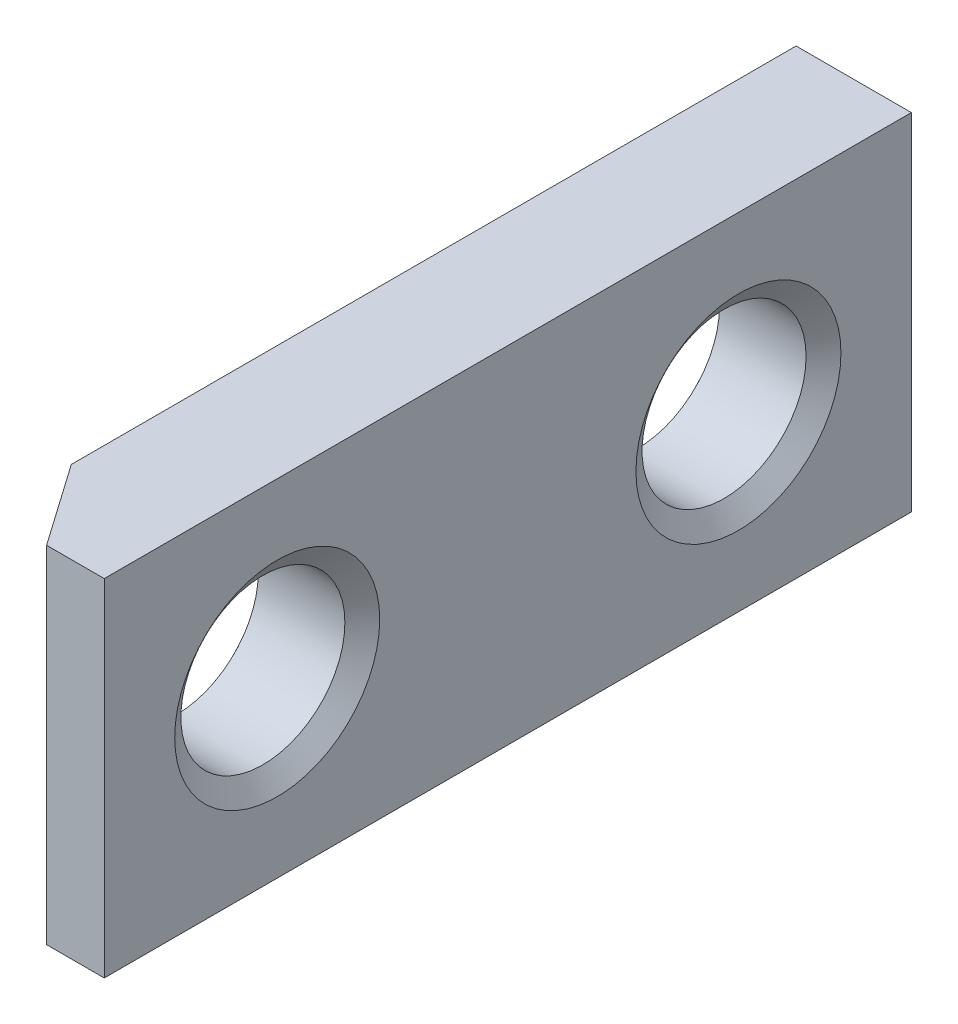
ISO-10303-21;
HEADER;
FILE_DESCRIPTION(('STEP AP214'),'2;1');
FILE_NAME('part.step','',(''),(''),'','','');
FILE_SCHEMA(('AUTOMOTIVE_DESIGN { 1 0 10303 214 1 1 1 1 }'));
ENDSEC;
DATA;
#1=APPLICATION_CONTEXT('core data for automotive mechanical design processes');
#2=APPLICATION_PROTOCOL_DEFINITION('international standard','automotive_design',2000,#1);
#3=PRODUCT_CONTEXT('',#1,'mechanical');
#4=PRODUCT('Part','Part','',(#3));
#5=PRODUCT_RELATED_PRODUCT_CATEGORY('part','',(#4));
#6=PRODUCT_DEFINITION_FORMATION('','',#4);
#7=PRODUCT_DEFINITION_CONTEXT('part definition',#1,'design');
#8=PRODUCT_DEFINITION('design','',#6,#7);
#9=PRODUCT_DEFINITION_SHAPE('','',#8);
#10=(LENGTH_UNIT() NAMED_UNIT(*) SI_UNIT(.MILLI.,.METRE.));
#11=(NAMED_UNIT(*) PLANE_ANGLE_UNIT() SI_UNIT($,.RADIAN.));
#12=(NAMED_UNIT(*) SI_UNIT($,.STERADIAN.) SOLID_ANGLE_UNIT());
#13=UNCERTAINTY_MEASURE_WITH_UNIT(LENGTH_MEASURE(1.E-05),#10,'distance_accuracy_value','');
#14=(GEOMETRIC_REPRESENTATION_CONTEXT(3) GLOBAL_UNCERTAINTY_ASSIGNED_CONTEXT((#13)) GLOBAL_UNIT_ASSIGNED_CONTEXT((#10,
#11,#12)) REPRESENTATION_CONTEXT('',''));
#15=CARTESIAN_POINT('',(0.,0.,0.));
#16=DIRECTION('',(0.,0.,1.));
#17=DIRECTION('',(1.,0.,0.));
#18=AXIS2_PLACEMENT_3D('',#15,#16,#17);
#19=CARTESIAN_POINT('',(2.,3.,-7.));
#20=DIRECTION('',(-1.,0.,0.));
#21=DIRECTION('',(0.,0.,1.));
#22=AXIS2_PLACEMENT_3D('',#19,#20,#21);
#23=PLANE('',#22);
#24=DIRECTION('',(0.,1.,0.));
#25=VECTOR('',#24,1.);
#26=CARTESIAN_POINT('',(2.,-3.,-7.));
#27=LINE('',#26,#25);
#28=CARTESIAN_POINT('',(2.,-3.,-7.));
#29=VERTEX_POINT('',#28);
#30=CARTESIAN_POINT('',(2.,3.,-7.));
#31=VERTEX_POINT('',#30);
#32=EDGE_CURVE('E96',#29,#31,#27,.T.);
#33=ORIENTED_EDGE('',*,*,#32,.T.);
#34=DIRECTION('',(0.,0.,1.));
#35=VECTOR('',#34,1.);
#36=CARTESIAN_POINT('',(2.,3.,7.));
#37=LINE('',#36,#35);
#38=CARTESIAN_POINT('',(2.,3.,7.));
#39=VERTEX_POINT('',#38);
#40=EDGE_CURVE('E85',#31,#39,#37,.T.);
#41=ORIENTED_EDGE('',*,*,#40,.T.);
#42=DIRECTION('',(0.,-1.,0.));
#43=VECTOR('',#42,1.);
#44=CARTESIAN_POINT('',(2.,-3.,7.));
#45=LINE('',#44,#43);
#46=CARTESIAN_POINT('',(2.,-3.,7.));
#47=VERTEX_POINT('',#46);
#48=EDGE_CURVE('E95',#39,#47,#45,.T.);
#49=ORIENTED_EDGE('',*,*,#48,.T.);
#50=DIRECTION('',(0.,0.,-1.));
#51=VECTOR('',#50,1.);
#52=CARTESIAN_POINT('',(2.,-3.,7.));
#53=LINE('',#52,#51);
#54=EDGE_CURVE('E101',#47,#29,#53,.T.);
#55=ORIENTED_EDGE('',*,*,#54,.T.);
#56=EDGE_LOOP('',(#33,#41,#49,#55));
#57=FACE_BOUND('',#56,.T.);
#58=CARTESIAN_POINT('',(2.,0.,-4.));
#59=DIRECTION('',(1.,0.,0.));
#60=DIRECTION('',(0.,0.,-1.));
#61=AXIS2_PLACEMENT_3D('',#58,#59,#60);
#62=CIRCLE('',#61,1.778);
#63=CARTESIAN_POINT('',(2.,0.,-5.778));
#64=VERTEX_POINT('',#63);
#65=EDGE_CURVE('E253',#64,#64,#62,.T.);
#66=ORIENTED_EDGE('',*,*,#65,.F.);
#67=EDGE_LOOP('',(#66));
#68=FACE_BOUND('',#67,.T.);
#69=CARTESIAN_POINT('',(2.,0.,4.));
#70=DIRECTION('',(1.,0.,0.));
#71=DIRECTION('',(0.,0.,-1.));
#72=AXIS2_PLACEMENT_3D('',#69,#70,#71);
#73=CIRCLE('',#72,1.778);
#74=CARTESIAN_POINT('',(2.,0.,2.222));
#75=VERTEX_POINT('',#74);
#76=EDGE_CURVE('E239',#75,#75,#73,.T.);
#77=ORIENTED_EDGE('',*,*,#76,.F.);
#78=EDGE_LOOP('',(#77));
#79=FACE_BOUND('',#78,.T.);
#80=ADVANCED_FACE('F31',(#57,#68,#79),#23,.F.);
#81=CARTESIAN_POINT('',(2.,-3.,-7.));
#82=DIRECTION('',(0.,0.,1.));
#83=DIRECTION('',(1.,0.,0.));
#84=AXIS2_PLACEMENT_3D('',#81,#82,#83);
#85=PLANE('',#84);
#86=DIRECTION('',(0.,1.,0.));
#87=VECTOR('',#86,1.);
#88=CARTESIAN_POINT('',(0.,-3.,-7.));
#89=LINE('',#88,#87);
#90=CARTESIAN_POINT('',(0.,-3.,-7.));
#91=VERTEX_POINT('',#90);
#92=CARTESIAN_POINT('',(0.,3.,-7.));
#93=VERTEX_POINT('',#92);
#94=EDGE_CURVE('E109',#91,#93,#89,.T.);
#95=ORIENTED_EDGE('',*,*,#94,.T.);
#96=DIRECTION('',(-1.,0.,0.));
#97=VECTOR('',#96,1.);
#98=CARTESIAN_POINT('',(2.,3.,-7.));
#99=LINE('',#98,#97);
#100=EDGE_CURVE('E89',#31,#93,#99,.T.);
#101=ORIENTED_EDGE('',*,*,#100,.F.);
#102=ORIENTED_EDGE('',*,*,#32,.F.);
#103=DIRECTION('',(-1.,0.,0.));
#104=VECTOR('',#103,1.);
#105=CARTESIAN_POINT('',(2.,-3.,-7.));
#106=LINE('',#105,#104);
#107=EDGE_CURVE('E264',#29,#91,#106,.T.);
#108=ORIENTED_EDGE('',*,*,#107,.T.);
#109=EDGE_LOOP('',(#95,#101,#102,#108));
#110=FACE_BOUND('',#109,.T.);
#111=ADVANCED_FACE('F107',(#110),#85,.F.);
#112=CARTESIAN_POINT('',(2.,3.,7.));
#113=DIRECTION('',(0.,-1.,0.));
#114=DIRECTION('',(0.,0.,-1.));
#115=AXIS2_PLACEMENT_3D('',#112,#113,#114);
#116=PLANE('',#115);
#117=DIRECTION('',(0.,0.,1.));
#118=VECTOR('',#117,1.);
#119=CARTESIAN_POINT('',(0.,3.,7.));
#120=LINE('',#119,#118);
#121=CARTESIAN_POINT('',(0.,3.,5.57185199325786));
#122=VERTEX_POINT('',#121);
#123=EDGE_CURVE('E266',#93,#122,#120,.T.);
#124=ORIENTED_EDGE('',*,*,#123,.T.);
#125=DIRECTION('',(0.573576436351042,0.,0.819152044288994));
#126=VECTOR('',#125,1.);
#127=CARTESIAN_POINT('',(1.00000000000001,3.,7.));
#128=LINE('',#127,#126);
#129=CARTESIAN_POINT('',(1.00000000000001,3.,7.));
#130=VERTEX_POINT('',#129);
#131=EDGE_CURVE('E11',#122,#130,#128,.T.);
#132=ORIENTED_EDGE('',*,*,#131,.T.);
#133=DIRECTION('',(-1.,0.,0.));
#134=VECTOR('',#133,1.);
#135=CARTESIAN_POINT('',(2.,3.,7.));
#136=LINE('',#135,#134);
#137=EDGE_CURVE('E92',#39,#130,#136,.T.);
#138=ORIENTED_EDGE('',*,*,#137,.F.);
#139=ORIENTED_EDGE('',*,*,#40,.F.);
#140=ORIENTED_EDGE('',*,*,#100,.T.);
#141=EDGE_LOOP('',(#124,#132,#138,#139,#140));
#142=FACE_BOUND('',#141,.T.);
#143=ADVANCED_FACE('F87',(#142),#116,.F.);
#144=CARTESIAN_POINT('',(2.,-3.,7.));
#145=DIRECTION('',(0.,0.,-1.));
#146=DIRECTION('',(-1.,0.,0.));
#147=AXIS2_PLACEMENT_3D('',#144,#145,#146);
#148=PLANE('',#147);
#149=ORIENTED_EDGE('',*,*,#137,.T.);
#150=DIRECTION('',(0.,-1.,0.));
#151=VECTOR('',#150,1.);
#152=CARTESIAN_POINT('',(1.00000000000001,-3.,7.));
#153=LINE('',#152,#151);
#154=CARTESIAN_POINT('',(1.00000000000001,-3.,7.));
#155=VERTEX_POINT('',#154);
#156=EDGE_CURVE('E110',#130,#155,#153,.T.);
#157=ORIENTED_EDGE('',*,*,#156,.T.);
#158=DIRECTION('',(-1.,0.,0.));
#159=VECTOR('',#158,1.);
#160=CARTESIAN_POINT('',(2.,-3.,7.));
#161=LINE('',#160,#159);
#162=EDGE_CURVE('E115',#47,#155,#161,.T.);
#163=ORIENTED_EDGE('',*,*,#162,.F.);
#164=ORIENTED_EDGE('',*,*,#48,.F.);
#165=EDGE_LOOP('',(#149,#157,#163,#164));
#166=FACE_BOUND('',#165,.T.);
#167=ADVANCED_FACE('F153',(#166),#148,.F.);
#168=CARTESIAN_POINT('',(2.,-3.,7.));
#169=DIRECTION('',(0.,1.,0.));
#170=DIRECTION('',(0.,0.,1.));
#171=AXIS2_PLACEMENT_3D('',#168,#169,#170);
#172=PLANE('',#171);
#173=ORIENTED_EDGE('',*,*,#162,.T.);
#174=DIRECTION('',(-0.573576436351042,0.,-0.819152044288994));
#175=VECTOR('',#174,1.);
#176=CARTESIAN_POINT('',(1.00000000000001,-3.,7.));
#177=LINE('',#176,#175);
#178=CARTESIAN_POINT('',(0.,-3.,5.57185199325786));
#179=VERTEX_POINT('',#178);
#180=EDGE_CURVE('E113',#155,#179,#177,.T.);
#181=ORIENTED_EDGE('',*,*,#180,.T.);
#182=DIRECTION('',(0.,0.,-1.));
#183=VECTOR('',#182,1.);
#184=CARTESIAN_POINT('',(0.,-3.,7.));
#185=LINE('',#184,#183);
#186=EDGE_CURVE('E105',#179,#91,#185,.T.);
#187=ORIENTED_EDGE('',*,*,#186,.T.);
#188=ORIENTED_EDGE('',*,*,#107,.F.);
#189=ORIENTED_EDGE('',*,*,#54,.F.);
#190=EDGE_LOOP('',(#173,#181,#187,#188,#189));
#191=FACE_BOUND('',#190,.T.);
#192=ADVANCED_FACE('F150',(#191),#172,.F.);
#193=CARTESIAN_POINT('',(0.,3.,-7.));
#194=DIRECTION('',(-1.,0.,0.));
#195=DIRECTION('',(0.,0.,1.));
#196=AXIS2_PLACEMENT_3D('',#193,#194,#195);
#197=PLANE('',#196);
#198=ORIENTED_EDGE('',*,*,#186,.F.);
#199=DIRECTION('',(0.,1.,0.));
#200=VECTOR('',#199,1.);
#201=CARTESIAN_POINT('',(0.,3.,5.57185199325786));
#202=LINE('',#201,#200);
#203=CARTESIAN_POINT('',(0.,-0.831002594034026,5.57185199325786));
#204=VERTEX_POINT('',#203);
#205=EDGE_CURVE('E53',#179,#204,#202,.T.);
#206=ORIENTED_EDGE('',*,*,#205,.T.);
#207=CARTESIAN_POINT('',(0.,0.,4.));
#208=DIRECTION('',(1.,0.,0.));
#209=DIRECTION('',(0.,0.,-1.));
#210=AXIS2_PLACEMENT_3D('',#207,#208,#209);
#211=CIRCLE('',#210,1.778);
#212=CARTESIAN_POINT('',(0.,0.831002594034028,5.57185199325786));
#213=VERTEX_POINT('',#212);
#214=EDGE_CURVE('E237',#204,#213,#211,.T.);
#215=ORIENTED_EDGE('',*,*,#214,.T.);
#216=DIRECTION('',(0.,1.,0.));
#217=VECTOR('',#216,1.);
#218=CARTESIAN_POINT('',(0.,3.,5.57185199325786));
#219=LINE('',#218,#217);
#220=EDGE_CURVE('E47',#213,#122,#219,.T.);
#221=ORIENTED_EDGE('',*,*,#220,.T.);
#222=ORIENTED_EDGE('',*,*,#123,.F.);
#223=ORIENTED_EDGE('',*,*,#94,.F.);
#224=EDGE_LOOP('',(#198,#206,#215,#221,#222,#223));
#225=FACE_BOUND('',#224,.T.);
#226=CARTESIAN_POINT('',(0.,0.,-4.));
#227=DIRECTION('',(1.,0.,0.));
#228=DIRECTION('',(0.,0.,-1.));
#229=AXIS2_PLACEMENT_3D('',#226,#227,#228);
#230=CIRCLE('',#229,1.778);
#231=CARTESIAN_POINT('',(0.,0.,-5.778));
#232=VERTEX_POINT('',#231);
#233=EDGE_CURVE('E250',#232,#232,#230,.T.);
#234=ORIENTED_EDGE('',*,*,#233,.T.);
#235=EDGE_LOOP('',(#234));
#236=FACE_BOUND('',#235,.T.);
#237=ADVANCED_FACE('F144',(#225,#236),#197,.T.);
#238=CARTESIAN_POINT('',(0.248993800587373,0.,-4.));
#239=DIRECTION('',(-1.,0.,0.));
#240=DIRECTION('',(0.,0.,1.));
#241=AXIS2_PLACEMENT_3D('',#238,#239,#240);
#242=CONICAL_SURFACE('',#241,1.4224,0.959931088596882);
#243=ORIENTED_EDGE('',*,*,#233,.F.);
#244=EDGE_LOOP('',(#243));
#245=FACE_BOUND('',#244,.T.);
#246=CARTESIAN_POINT('',(0.248993800587373,0.,-4.));
#247=DIRECTION('',(1.,0.,0.));
#248=DIRECTION('',(0.,0.,-1.));
#249=AXIS2_PLACEMENT_3D('',#246,#247,#248);
#250=CIRCLE('',#249,1.4224);
#251=CARTESIAN_POINT('',(0.248993800587373,0.,-5.4224));
#252=VERTEX_POINT('',#251);
#253=EDGE_CURVE('E259',#252,#252,#250,.T.);
#254=ORIENTED_EDGE('',*,*,#253,.T.);
#255=EDGE_LOOP('',(#254));
#256=FACE_BOUND('',#255,.T.);
#257=ADVANCED_FACE('F140',(#245,#256),#242,.F.);
#258=CARTESIAN_POINT('',(2.,0.,-4.));
#259=DIRECTION('',(1.,0.,0.));
#260=DIRECTION('',(0.,0.,-1.));
#261=AXIS2_PLACEMENT_3D('',#258,#259,#260);
#262=CYLINDRICAL_SURFACE('',#261,1.4224);
#263=ORIENTED_EDGE('',*,*,#253,.F.);
#264=EDGE_LOOP('',(#263));
#265=FACE_BOUND('',#264,.T.);
#266=CARTESIAN_POINT('',(1.75100619941263,0.,-4.));
#267=DIRECTION('',(1.,0.,0.));
#268=DIRECTION('',(0.,0.,-1.));
#269=AXIS2_PLACEMENT_3D('',#266,#267,#268);
#270=CIRCLE('',#269,1.4224);
#271=CARTESIAN_POINT('',(1.75100619941263,0.,-5.4224));
#272=VERTEX_POINT('',#271);
#273=EDGE_CURVE('E256',#272,#272,#270,.T.);
#274=ORIENTED_EDGE('',*,*,#273,.T.);
#275=EDGE_LOOP('',(#274));
#276=FACE_BOUND('',#275,.T.);
#277=ADVANCED_FACE('F136',(#265,#276),#262,.F.);
#278=CARTESIAN_POINT('',(2.,0.,-4.));
#279=DIRECTION('',(1.,0.,0.));
#280=DIRECTION('',(0.,0.,-1.));
#281=AXIS2_PLACEMENT_3D('',#278,#279,#280);
#282=CONICAL_SURFACE('',#281,1.778,0.959931088596881);
#283=ORIENTED_EDGE('',*,*,#273,.F.);
#284=EDGE_LOOP('',(#283));
#285=FACE_BOUND('',#284,.T.);
#286=ORIENTED_EDGE('',*,*,#65,.T.);
#287=EDGE_LOOP('',(#286));
#288=FACE_BOUND('',#287,.T.);
#289=ADVANCED_FACE('F131',(#285,#288),#282,.F.);
#290=CARTESIAN_POINT('',(0.248993800587373,0.,4.));
#291=DIRECTION('',(-1.,0.,0.));
#292=DIRECTION('',(0.,0.,1.));
#293=AXIS2_PLACEMENT_3D('',#290,#291,#292);
#294=CONICAL_SURFACE('',#293,1.4224,0.959931088596882);
#295=ORIENTED_EDGE('',*,*,#214,.F.);
#296=CARTESIAN_POINT('',(0.,-0.831002594034028,5.57185199325786));
#297=CARTESIAN_POINT('',(0.0139738922372071,-0.750666063989369,5.59180877960286));
#298=CARTESIAN_POINT('',(0.026064994150882,-0.669300159304515,5.60907666270019));
#299=CARTESIAN_POINT('',(0.0462191684725842,-0.505011140824846,5.63785980658526));
#300=CARTESIAN_POINT('',(0.0542794116624237,-0.422086975542478,5.64937102683069));
#301=CARTESIAN_POINT('',(0.0659365462604486,-0.257451319358591,5.66601914037118));
#302=CARTESIAN_POINT('',(0.0696433516518529,-0.175763833673539,5.6713130071023));
#303=CARTESIAN_POINT('',(0.0728568839525601,-0.012195198668549,5.67590240685215));
#304=CARTESIAN_POINT('',(0.0723659212142171,0.0696858193292574,5.675201239396));
#305=CARTESIAN_POINT('',(0.0661635626818426,0.265492324502684,5.66634335342089));
#306=CARTESIAN_POINT('',(0.0584591416749154,0.37924864173589,5.65534029991675));
#307=CARTESIAN_POINT('',(0.0410150926676743,0.549026098495219,5.63042761609754));
#308=CARTESIAN_POINT('',(0.0341271809256541,0.60599858772834,5.62059065867256));
#309=CARTESIAN_POINT('',(0.0184576127370814,0.719135696964129,5.59821219609754));
#310=CARTESIAN_POINT('',(0.00967633911606112,0.775300477835006,5.58567123767903));
#311=CARTESIAN_POINT('',(0.,0.831002594034028,5.57185199325786));
#312=B_SPLINE_CURVE_WITH_KNOTS('',3,(#296,#297,#298,#299,#300,#301,#302,#303,#304,#305,#306,
#307,#308,#309,#310,#311),.UNSPECIFIED.,.F.,.F.,(4,2,2,2,2,2,2,4),(0.,0.251827339558577,
0.503831186917978,0.749325568693761,0.994684844865774,1.33734476051293,1.51193575078704,
1.68649147294029),.UNSPECIFIED.);
#313=EDGE_CURVE('E40',#204,#213,#312,.T.);
#314=ORIENTED_EDGE('',*,*,#313,.T.);
#315=EDGE_LOOP('',(#295,#314));
#316=FACE_BOUND('',#315,.T.);
#317=CARTESIAN_POINT('',(0.248993800587373,0.,4.));
#318=DIRECTION('',(1.,0.,0.));
#319=DIRECTION('',(0.,0.,-1.));
#320=AXIS2_PLACEMENT_3D('',#317,#318,#319);
#321=CIRCLE('',#320,1.4224);
#322=CARTESIAN_POINT('',(0.248993800587373,0.,2.5776));
#323=VERTEX_POINT('',#322);
#324=EDGE_CURVE('E247',#323,#323,#321,.T.);
#325=ORIENTED_EDGE('',*,*,#324,.T.);
#326=EDGE_LOOP('',(#325));
#327=FACE_BOUND('',#326,.T.);
#328=ADVANCED_FACE('F125',(#316,#327),#294,.F.);
#329=CARTESIAN_POINT('',(2.,0.,4.));
#330=DIRECTION('',(1.,0.,0.));
#331=DIRECTION('',(0.,0.,-1.));
#332=AXIS2_PLACEMENT_3D('',#329,#330,#331);
#333=CYLINDRICAL_SURFACE('',#332,1.4224);
#334=ORIENTED_EDGE('',*,*,#324,.F.);
#335=EDGE_LOOP('',(#334));
#336=FACE_BOUND('',#335,.T.);
#337=CARTESIAN_POINT('',(1.75100619941263,0.,4.));
#338=DIRECTION('',(1.,0.,0.));
#339=DIRECTION('',(0.,0.,-1.));
#340=AXIS2_PLACEMENT_3D('',#337,#338,#339);
#341=CIRCLE('',#340,1.4224);
#342=CARTESIAN_POINT('',(1.75100619941263,0.,2.5776));
#343=VERTEX_POINT('',#342);
#344=EDGE_CURVE('E242',#343,#343,#341,.T.);
#345=ORIENTED_EDGE('',*,*,#344,.T.);
#346=EDGE_LOOP('',(#345));
#347=FACE_BOUND('',#346,.T.);
#348=ADVANCED_FACE('F130',(#336,#347),#333,.F.);
#349=CARTESIAN_POINT('',(2.,0.,4.));
#350=DIRECTION('',(1.,0.,0.));
#351=DIRECTION('',(0.,0.,-1.));
#352=AXIS2_PLACEMENT_3D('',#349,#350,#351);
#353=CONICAL_SURFACE('',#352,1.778,0.959931088596881);
#354=ORIENTED_EDGE('',*,*,#344,.F.);
#355=EDGE_LOOP('',(#354));
#356=FACE_BOUND('',#355,.T.);
#357=ORIENTED_EDGE('',*,*,#76,.T.);
#358=EDGE_LOOP('',(#357));
#359=FACE_BOUND('',#358,.T.);
#360=ADVANCED_FACE('F216',(#356,#359),#353,.F.);
#361=CARTESIAN_POINT('',(1.00000000000001,-3.,7.));
#362=DIRECTION('',(-0.819152044288994,0.,0.573576436351042));
#363=DIRECTION('',(0.573576436351042,0.,0.819152044288994));
#364=AXIS2_PLACEMENT_3D('',#361,#362,#363);
#365=PLANE('',#364);
#366=ORIENTED_EDGE('',*,*,#313,.F.);
#367=ORIENTED_EDGE('',*,*,#205,.F.);
#368=ORIENTED_EDGE('',*,*,#180,.F.);
#369=ORIENTED_EDGE('',*,*,#156,.F.);
#370=ORIENTED_EDGE('',*,*,#131,.F.);
#371=ORIENTED_EDGE('',*,*,#220,.F.);
#372=EDGE_LOOP('',(#366,#367,#368,#369,#370,#371));
#373=FACE_BOUND('',#372,.T.);
#374=ADVANCED_FACE('F33',(#373),#365,.T.);
#375=CLOSED_SHELL('',(#80,#111,#143,#167,#192,#237,#257,#277,#289,#328,#348,#360,#374));
#376=MANIFOLD_SOLID_BREP('B2',#375);
#377=ADVANCED_BREP_SHAPE_REPRESENTATION('',(#18,#376),#14);
#378=SHAPE_DEFINITION_REPRESENTATION(#9,#377);
ENDSEC;
END-ISO-10303-21;
